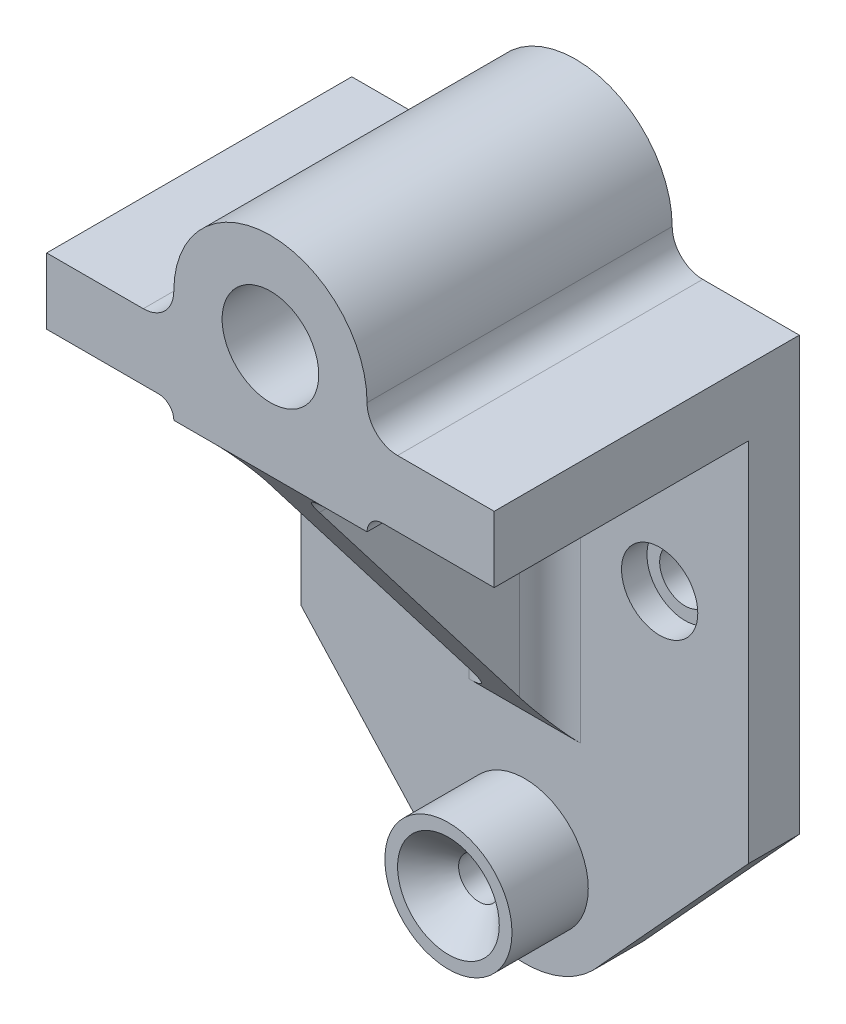
ISO-10303-21;
HEADER;
FILE_DESCRIPTION(('STEP AP214'),'2;1');
FILE_NAME('part.step','',(''),(''),'','','');
FILE_SCHEMA(('AUTOMOTIVE_DESIGN { 1 0 10303 214 1 1 1 1 }'));
ENDSEC;
DATA;
#1=APPLICATION_CONTEXT('core data for automotive mechanical design processes');
#2=APPLICATION_PROTOCOL_DEFINITION('international standard','automotive_design',2000,#1);
#3=PRODUCT_CONTEXT('',#1,'mechanical');
#4=PRODUCT('Part','Part','',(#3));
#5=PRODUCT_RELATED_PRODUCT_CATEGORY('part','',(#4));
#6=PRODUCT_DEFINITION_FORMATION('','',#4);
#7=PRODUCT_DEFINITION_CONTEXT('part definition',#1,'design');
#8=PRODUCT_DEFINITION('design','',#6,#7);
#9=PRODUCT_DEFINITION_SHAPE('','',#8);
#10=(LENGTH_UNIT() NAMED_UNIT(*) SI_UNIT(.MILLI.,.METRE.));
#11=(NAMED_UNIT(*) PLANE_ANGLE_UNIT() SI_UNIT($,.RADIAN.));
#12=(NAMED_UNIT(*) SI_UNIT($,.STERADIAN.) SOLID_ANGLE_UNIT());
#13=UNCERTAINTY_MEASURE_WITH_UNIT(LENGTH_MEASURE(1.E-05),#10,'distance_accuracy_value','');
#14=(GEOMETRIC_REPRESENTATION_CONTEXT(3) GLOBAL_UNCERTAINTY_ASSIGNED_CONTEXT((#13)) GLOBAL_UNIT_ASSIGNED_CONTEXT((#10,
#11,#12)) REPRESENTATION_CONTEXT('',''));
#15=CARTESIAN_POINT('',(0.,0.,0.));
#16=DIRECTION('',(0.,0.,1.));
#17=DIRECTION('',(1.,0.,0.));
#18=AXIS2_PLACEMENT_3D('',#15,#16,#17);
#19=CARTESIAN_POINT('',(0.,0.,60.));
#20=DIRECTION('',(0.,1.,0.));
#21=DIRECTION('',(0.,0.,1.));
#22=AXIS2_PLACEMENT_3D('',#19,#20,#21);
#23=PLANE('',#22);
#24=DIRECTION('',(1.,0.,0.));
#25=VECTOR('',#24,1.);
#26=CARTESIAN_POINT('',(0.,0.,60.));
#27=LINE('',#26,#25);
#28=CARTESIAN_POINT('',(30.,0.,60.));
#29=VERTEX_POINT('',#28);
#30=CARTESIAN_POINT('',(38.,0.,60.));
#31=VERTEX_POINT('',#30);
#32=EDGE_CURVE('E232',#29,#31,#27,.T.);
#33=ORIENTED_EDGE('',*,*,#32,.F.);
#34=DIRECTION('',(0.,0.,1.));
#35=VECTOR('',#34,1.);
#36=CARTESIAN_POINT('',(30.,0.,10.));
#37=LINE('',#36,#35);
#38=CARTESIAN_POINT('',(30.,0.,10.));
#39=VERTEX_POINT('',#38);
#40=EDGE_CURVE('E314',#29,#39,#37,.F.);
#41=ORIENTED_EDGE('',*,*,#40,.T.);
#42=DIRECTION('',(1.,0.,0.));
#43=VECTOR('',#42,1.);
#44=CARTESIAN_POINT('',(0.,0.,10.));
#45=LINE('',#44,#43);
#46=CARTESIAN_POINT('',(38.,0.,10.));
#47=VERTEX_POINT('',#46);
#48=EDGE_CURVE('E358',#39,#47,#45,.T.);
#49=ORIENTED_EDGE('',*,*,#48,.T.);
#50=DIRECTION('',(0.,0.,-1.));
#51=VECTOR('',#50,1.);
#52=CARTESIAN_POINT('',(38.,0.,60.));
#53=LINE('',#52,#51);
#54=EDGE_CURVE('E274',#31,#47,#53,.T.);
#55=ORIENTED_EDGE('',*,*,#54,.F.);
#56=EDGE_LOOP('',(#33,#41,#49,#55));
#57=FACE_BOUND('',#56,.T.);
#58=ADVANCED_FACE('F37',(#57),#23,.F.);
#59=CARTESIAN_POINT('',(0.,0.,10.));
#60=DIRECTION('',(0.,0.,1.));
#61=DIRECTION('',(1.,0.,0.));
#62=AXIS2_PLACEMENT_3D('',#59,#60,#61);
#63=PLANE('',#62);
#64=CARTESIAN_POINT('',(45.5363519866529,-31.3518574194529,10.));
#65=DIRECTION('',(0.,0.,1.));
#66=DIRECTION('',(1.,0.,0.));
#67=AXIS2_PLACEMENT_3D('',#64,#65,#66);
#68=CIRCLE('',#67,7.50000000000001);
#69=CARTESIAN_POINT('',(53.0363519866529,-31.3518574194529,10.));
#70=VERTEX_POINT('',#69);
#71=EDGE_CURVE('E768',#70,#70,#68,.T.);
#72=ORIENTED_EDGE('',*,*,#71,.F.);
#73=EDGE_LOOP('',(#72));
#74=FACE_BOUND('',#73,.T.);
#75=CARTESIAN_POINT('',(-7.53635198665288,-31.3518574194529,10.));
#76=DIRECTION('',(0.,0.,1.));
#77=DIRECTION('',(1.,0.,0.));
#78=AXIS2_PLACEMENT_3D('',#75,#76,#77);
#79=CIRCLE('',#78,7.50000000000001);
#80=CARTESIAN_POINT('',(-0.0363519866528666,-31.3518574194529,10.));
#81=VERTEX_POINT('',#80);
#82=EDGE_CURVE('E778',#81,#81,#79,.T.);
#83=ORIENTED_EDGE('',*,*,#82,.F.);
#84=EDGE_LOOP('',(#83));
#85=FACE_BOUND('',#84,.T.);
#86=CARTESIAN_POINT('',(19.,-89.,10.));
#87=DIRECTION('',(0.,0.,1.));
#88=DIRECTION('',(1.,0.,0.));
#89=AXIS2_PLACEMENT_3D('',#86,#87,#88);
#90=CIRCLE('',#89,12.5);
#91=CARTESIAN_POINT('',(31.5,-89.,10.));
#92=VERTEX_POINT('',#91);
#93=EDGE_CURVE('E361',#92,#92,#90,.T.);
#94=ORIENTED_EDGE('',*,*,#93,.F.);
#95=EDGE_LOOP('',(#94));
#96=FACE_BOUND('',#95,.T.);
#97=ORIENTED_EDGE('',*,*,#48,.F.);
#98=DIRECTION('',(0.,1.,0.));
#99=VECTOR('',#98,1.);
#100=CARTESIAN_POINT('',(30.,0.,10.));
#101=LINE('',#100,#99);
#102=CARTESIAN_POINT('',(30.,-65.,9.99999999999999));
#103=VERTEX_POINT('',#102);
#104=EDGE_CURVE('E330',#39,#103,#101,.F.);
#105=ORIENTED_EDGE('',*,*,#104,.T.);
#106=DIRECTION('',(-1.,0.,0.));
#107=VECTOR('',#106,1.);
#108=CARTESIAN_POINT('',(24.,-65.,9.99999999999999));
#109=LINE('',#108,#107);
#110=CARTESIAN_POINT('',(8.,-65.,9.99999999999999));
#111=VERTEX_POINT('',#110);
#112=EDGE_CURVE('E341',#103,#111,#109,.T.);
#113=ORIENTED_EDGE('',*,*,#112,.T.);
#114=DIRECTION('',(0.,1.,0.));
#115=VECTOR('',#114,1.);
#116=CARTESIAN_POINT('',(8.,-6.,10.));
#117=LINE('',#116,#115);
#118=CARTESIAN_POINT('',(8.,0.,10.));
#119=VERTEX_POINT('',#118);
#120=EDGE_CURVE('E327',#111,#119,#117,.T.);
#121=ORIENTED_EDGE('',*,*,#120,.T.);
#122=CARTESIAN_POINT('',(0.,0.,10.));
#123=VERTEX_POINT('',#122);
#124=EDGE_CURVE('E360',#123,#119,#45,.T.);
#125=ORIENTED_EDGE('',*,*,#124,.F.);
#126=CARTESIAN_POINT('',(-3.,0.,10.));
#127=DIRECTION('',(0.,0.,1.));
#128=DIRECTION('',(1.,0.,0.));
#129=AXIS2_PLACEMENT_3D('',#126,#127,#128);
#130=CIRCLE('',#129,3.);
#131=CARTESIAN_POINT('',(-3.,3.,10.));
#132=VERTEX_POINT('',#131);
#133=EDGE_CURVE('E296',#123,#132,#130,.T.);
#134=ORIENTED_EDGE('',*,*,#133,.T.);
#135=DIRECTION('',(1.,0.,0.));
#136=VECTOR('',#135,1.);
#137=CARTESIAN_POINT('',(0.,3.,10.));
#138=LINE('',#137,#136);
#139=CARTESIAN_POINT('',(-25.,3.,10.));
#140=VERTEX_POINT('',#139);
#141=EDGE_CURVE('E207',#140,#132,#138,.T.);
#142=ORIENTED_EDGE('',*,*,#141,.F.);
#143=DIRECTION('',(0.,-1.,0.));
#144=VECTOR('',#143,1.);
#145=CARTESIAN_POINT('',(-25.,0.,10.));
#146=LINE('',#145,#144);
#147=CARTESIAN_POINT('',(-25.,-69.,10.));
#148=VERTEX_POINT('',#147);
#149=EDGE_CURVE('E200',#140,#148,#146,.T.);
#150=ORIENTED_EDGE('',*,*,#149,.T.);
#151=DIRECTION('',(0.674608213282389,-0.738175967213741,0.));
#152=VECTOR('',#151,1.);
#153=CARTESIAN_POINT('',(-47.9831843170728,-43.8511299167875,10.));
#154=LINE('',#153,#152);
#155=CARTESIAN_POINT('',(4.52041849490884,-101.302102236505,10.));
#156=VERTEX_POINT('',#155);
#157=EDGE_CURVE('E190',#148,#156,#154,.T.);
#158=ORIENTED_EDGE('',*,*,#157,.T.);
#159=CARTESIAN_POINT('',(19.,-89.,10.));
#160=DIRECTION('',(0.,0.,1.));
#161=DIRECTION('',(1.,0.,0.));
#162=AXIS2_PLACEMENT_3D('',#159,#160,#161);
#163=CIRCLE('',#162,19.);
#164=CARTESIAN_POINT('',(32.3856262440448,-102.484250444676,10.));
#165=VERTEX_POINT('',#164);
#166=EDGE_CURVE('E199',#156,#165,#163,.T.);
#167=ORIENTED_EDGE('',*,*,#166,.T.);
#168=DIRECTION('',(-0.674771623689524,-0.738026595634198,0.));
#169=VECTOR('',#168,1.);
#170=CARTESIAN_POINT('',(68.677004013482,-62.7908178139399,10.));
#171=LINE('',#170,#169);
#172=CARTESIAN_POINT('',(63.,-69.,10.));
#173=VERTEX_POINT('',#172);
#174=EDGE_CURVE('E371',#173,#165,#171,.T.);
#175=ORIENTED_EDGE('',*,*,#174,.F.);
#176=DIRECTION('',(0.,-1.,0.));
#177=VECTOR('',#176,1.);
#178=CARTESIAN_POINT('',(63.,0.,10.));
#179=LINE('',#178,#177);
#180=CARTESIAN_POINT('',(63.,3.,9.99999999999999));
#181=VERTEX_POINT('',#180);
#182=EDGE_CURVE('E374',#181,#173,#179,.T.);
#183=ORIENTED_EDGE('',*,*,#182,.F.);
#184=DIRECTION('',(1.,0.,0.));
#185=VECTOR('',#184,1.);
#186=CARTESIAN_POINT('',(0.,3.,10.));
#187=LINE('',#186,#185);
#188=CARTESIAN_POINT('',(41.,3.,10.));
#189=VERTEX_POINT('',#188);
#190=EDGE_CURVE('E377',#189,#181,#187,.T.);
#191=ORIENTED_EDGE('',*,*,#190,.F.);
#192=CARTESIAN_POINT('',(41.,0.,10.));
#193=DIRECTION('',(0.,0.,1.));
#194=DIRECTION('',(1.,0.,0.));
#195=AXIS2_PLACEMENT_3D('',#192,#193,#194);
#196=CIRCLE('',#195,3.);
#197=EDGE_CURVE('E293',#189,#47,#196,.T.);
#198=ORIENTED_EDGE('',*,*,#197,.T.);
#199=EDGE_LOOP('',(#97,#105,#113,#121,#125,#134,#142,#150,#158,#167,#175,#183,#191,#198));
#200=FACE_BOUND('',#199,.T.);
#201=ADVANCED_FACE('F205',(#74,#85,#96,#200),#63,.T.);
#202=CARTESIAN_POINT('',(19.,22.,60.));
#203=DIRECTION('',(0.,0.,1.));
#204=DIRECTION('',(1.,0.,0.));
#205=AXIS2_PLACEMENT_3D('',#202,#203,#204);
#206=PLANE('',#205);
#207=DIRECTION('',(1.,0.,0.));
#208=VECTOR('',#207,1.);
#209=CARTESIAN_POINT('',(-25.,3.,60.));
#210=LINE('',#209,#208);
#211=CARTESIAN_POINT('',(-25.,3.,60.));
#212=VERTEX_POINT('',#211);
#213=CARTESIAN_POINT('',(-3.,3.,60.));
#214=VERTEX_POINT('',#213);
#215=EDGE_CURVE('E245',#212,#214,#210,.T.);
#216=ORIENTED_EDGE('',*,*,#215,.T.);
#217=CARTESIAN_POINT('',(-3.,0.,60.));
#218=DIRECTION('',(0.,0.,1.));
#219=DIRECTION('',(1.,0.,0.));
#220=AXIS2_PLACEMENT_3D('',#217,#218,#219);
#221=CIRCLE('',#220,3.);
#222=CARTESIAN_POINT('',(0.,0.,60.));
#223=VERTEX_POINT('',#222);
#224=EDGE_CURVE('E303',#214,#223,#221,.F.);
#225=ORIENTED_EDGE('',*,*,#224,.T.);
#226=CARTESIAN_POINT('',(8.,0.,60.));
#227=VERTEX_POINT('',#226);
#228=EDGE_CURVE('E228',#223,#227,#27,.T.);
#229=ORIENTED_EDGE('',*,*,#228,.T.);
#230=DIRECTION('',(-1.,0.,0.));
#231=VECTOR('',#230,1.);
#232=CARTESIAN_POINT('',(24.,0.,60.));
#233=LINE('',#232,#231);
#234=EDGE_CURVE('E383',#29,#227,#233,.T.);
#235=ORIENTED_EDGE('',*,*,#234,.F.);
#236=ORIENTED_EDGE('',*,*,#32,.T.);
#237=CARTESIAN_POINT('',(41.,0.,60.));
#238=DIRECTION('',(0.,0.,1.));
#239=DIRECTION('',(1.,0.,0.));
#240=AXIS2_PLACEMENT_3D('',#237,#238,#239);
#241=CIRCLE('',#240,3.);
#242=CARTESIAN_POINT('',(41.,3.,60.));
#243=VERTEX_POINT('',#242);
#244=EDGE_CURVE('E305',#31,#243,#241,.F.);
#245=ORIENTED_EDGE('',*,*,#244,.T.);
#246=DIRECTION('',(1.,0.,0.));
#247=VECTOR('',#246,1.);
#248=CARTESIAN_POINT('',(38.,3.,60.));
#249=LINE('',#248,#247);
#250=CARTESIAN_POINT('',(63.,3.,60.));
#251=VERTEX_POINT('',#250);
#252=EDGE_CURVE('E231',#243,#251,#249,.T.);
#253=ORIENTED_EDGE('',*,*,#252,.T.);
#254=DIRECTION('',(0.,1.,0.));
#255=VECTOR('',#254,1.);
#256=CARTESIAN_POINT('',(63.,3.,60.));
#257=LINE('',#256,#255);
#258=CARTESIAN_POINT('',(63.,16.,60.));
#259=VERTEX_POINT('',#258);
#260=EDGE_CURVE('E234',#251,#259,#257,.T.);
#261=ORIENTED_EDGE('',*,*,#260,.T.);
#262=DIRECTION('',(-1.,0.,0.));
#263=VECTOR('',#262,1.);
#264=CARTESIAN_POINT('',(63.,16.,60.));
#265=LINE('',#264,#263);
#266=CARTESIAN_POINT('',(44.,16.,60.));
#267=VERTEX_POINT('',#266);
#268=EDGE_CURVE('E236',#259,#267,#265,.T.);
#269=ORIENTED_EDGE('',*,*,#268,.T.);
#270=CARTESIAN_POINT('',(44.,22.,60.));
#271=DIRECTION('',(0.,0.,1.));
#272=DIRECTION('',(1.,0.,0.));
#273=AXIS2_PLACEMENT_3D('',#270,#271,#272);
#274=CIRCLE('',#273,6.);
#275=CARTESIAN_POINT('',(38.,22.,60.));
#276=VERTEX_POINT('',#275);
#277=EDGE_CURVE('E291',#267,#276,#274,.F.);
#278=ORIENTED_EDGE('',*,*,#277,.T.);
#279=CARTESIAN_POINT('',(19.,22.,60.));
#280=DIRECTION('',(0.,0.,1.));
#281=DIRECTION('',(1.,0.,0.));
#282=AXIS2_PLACEMENT_3D('',#279,#280,#281);
#283=CIRCLE('',#282,19.);
#284=CARTESIAN_POINT('',(0.,22.,60.));
#285=VERTEX_POINT('',#284);
#286=EDGE_CURVE('E239',#276,#285,#283,.T.);
#287=ORIENTED_EDGE('',*,*,#286,.T.);
#288=CARTESIAN_POINT('',(-6.,22.,60.));
#289=DIRECTION('',(0.,0.,1.));
#290=DIRECTION('',(1.,0.,0.));
#291=AXIS2_PLACEMENT_3D('',#288,#289,#290);
#292=CIRCLE('',#291,6.);
#293=CARTESIAN_POINT('',(-6.,16.,60.));
#294=VERTEX_POINT('',#293);
#295=EDGE_CURVE('E285',#285,#294,#292,.F.);
#296=ORIENTED_EDGE('',*,*,#295,.T.);
#297=DIRECTION('',(-1.,0.,0.));
#298=VECTOR('',#297,1.);
#299=CARTESIAN_POINT('',(0.,16.,60.));
#300=LINE('',#299,#298);
#301=CARTESIAN_POINT('',(-25.,16.,60.));
#302=VERTEX_POINT('',#301);
#303=EDGE_CURVE('E241',#294,#302,#300,.T.);
#304=ORIENTED_EDGE('',*,*,#303,.T.);
#305=DIRECTION('',(0.,-1.,0.));
#306=VECTOR('',#305,1.);
#307=CARTESIAN_POINT('',(-25.,16.,60.));
#308=LINE('',#307,#306);
#309=EDGE_CURVE('E243',#302,#212,#308,.T.);
#310=ORIENTED_EDGE('',*,*,#309,.T.);
#311=EDGE_LOOP('',(#216,#225,#229,#235,#236,#245,#253,#261,#269,#278,#287,#296,#304,#310));
#312=FACE_BOUND('',#311,.T.);
#313=CARTESIAN_POINT('',(19.,22.,60.));
#314=DIRECTION('',(0.,0.,1.));
#315=DIRECTION('',(1.,0.,0.));
#316=AXIS2_PLACEMENT_3D('',#313,#314,#315);
#317=CIRCLE('',#316,9.5);
#318=CARTESIAN_POINT('',(28.5,22.,60.));
#319=VERTEX_POINT('',#318);
#320=EDGE_CURVE('E219',#319,#319,#317,.T.);
#321=ORIENTED_EDGE('',*,*,#320,.F.);
#322=EDGE_LOOP('',(#321));
#323=FACE_BOUND('',#322,.T.);
#324=ADVANCED_FACE('F412',(#312,#323),#206,.T.);
#325=CARTESIAN_POINT('',(19.,22.,0.));
#326=DIRECTION('',(0.,0.,1.));
#327=DIRECTION('',(1.,0.,0.));
#328=AXIS2_PLACEMENT_3D('',#325,#326,#327);
#329=PLANE('',#328);
#330=CARTESIAN_POINT('',(45.5363519866529,-31.3518574194529,0.));
#331=DIRECTION('',(0.,0.,1.));
#332=DIRECTION('',(1.,0.,0.));
#333=AXIS2_PLACEMENT_3D('',#330,#331,#332);
#334=CIRCLE('',#333,5.00000000000001);
#335=CARTESIAN_POINT('',(50.5363519866529,-31.3518574194529,0.));
#336=VERTEX_POINT('',#335);
#337=EDGE_CURVE('E775',#336,#336,#334,.T.);
#338=ORIENTED_EDGE('',*,*,#337,.T.);
#339=EDGE_LOOP('',(#338));
#340=FACE_BOUND('',#339,.T.);
#341=CARTESIAN_POINT('',(-7.53635198665288,-31.3518574194529,0.));
#342=DIRECTION('',(0.,0.,1.));
#343=DIRECTION('',(1.,0.,0.));
#344=AXIS2_PLACEMENT_3D('',#341,#342,#343);
#345=CIRCLE('',#344,5.00000000000001);
#346=CARTESIAN_POINT('',(-2.53635198665287,-31.3518574194529,0.));
#347=VERTEX_POINT('',#346);
#348=EDGE_CURVE('E787',#347,#347,#345,.T.);
#349=ORIENTED_EDGE('',*,*,#348,.T.);
#350=EDGE_LOOP('',(#349));
#351=FACE_BOUND('',#350,.T.);
#352=DIRECTION('',(0.,1.,0.));
#353=VECTOR('',#352,1.);
#354=CARTESIAN_POINT('',(63.,3.,0.));
#355=LINE('',#354,#353);
#356=CARTESIAN_POINT('',(63.,-69.,0.));
#357=VERTEX_POINT('',#356);
#358=CARTESIAN_POINT('',(63.,16.,0.));
#359=VERTEX_POINT('',#358);
#360=EDGE_CURVE('E226',#357,#359,#355,.T.);
#361=ORIENTED_EDGE('',*,*,#360,.F.);
#362=DIRECTION('',(-0.674771623689524,-0.738026595634198,0.));
#363=VECTOR('',#362,1.);
#364=CARTESIAN_POINT('',(68.677004013482,-62.7908178139399,0.));
#365=LINE('',#364,#363);
#366=CARTESIAN_POINT('',(32.3856262440448,-102.484250444676,0.));
#367=VERTEX_POINT('',#366);
#368=EDGE_CURVE('E365',#357,#367,#365,.T.);
#369=ORIENTED_EDGE('',*,*,#368,.T.);
#370=CARTESIAN_POINT('',(19.,-89.,0.));
#371=DIRECTION('',(0.,0.,1.));
#372=DIRECTION('',(1.,0.,0.));
#373=AXIS2_PLACEMENT_3D('',#370,#371,#372);
#374=CIRCLE('',#373,19.);
#375=CARTESIAN_POINT('',(4.52041849490884,-101.302102236505,0.));
#376=VERTEX_POINT('',#375);
#377=EDGE_CURVE('E382',#376,#367,#374,.T.);
#378=ORIENTED_EDGE('',*,*,#377,.F.);
#379=DIRECTION('',(0.674608213282389,-0.738175967213741,0.));
#380=VECTOR('',#379,1.);
#381=CARTESIAN_POINT('',(-47.9831843170728,-43.8511299167875,0.));
#382=LINE('',#381,#380);
#383=CARTESIAN_POINT('',(-25.,-69.,0.));
#384=VERTEX_POINT('',#383);
#385=EDGE_CURVE('E380',#384,#376,#382,.T.);
#386=ORIENTED_EDGE('',*,*,#385,.F.);
#387=DIRECTION('',(0.,-1.,0.));
#388=VECTOR('',#387,1.);
#389=CARTESIAN_POINT('',(-25.,16.,0.));
#390=LINE('',#389,#388);
#391=CARTESIAN_POINT('',(-25.,16.,0.));
#392=VERTEX_POINT('',#391);
#393=EDGE_CURVE('E214',#392,#384,#390,.T.);
#394=ORIENTED_EDGE('',*,*,#393,.F.);
#395=DIRECTION('',(-1.,0.,0.));
#396=VECTOR('',#395,1.);
#397=CARTESIAN_POINT('',(0.,16.,0.));
#398=LINE('',#397,#396);
#399=CARTESIAN_POINT('',(-6.,16.,0.));
#400=VERTEX_POINT('',#399);
#401=EDGE_CURVE('E256',#400,#392,#398,.T.);
#402=ORIENTED_EDGE('',*,*,#401,.F.);
#403=CARTESIAN_POINT('',(-6.,22.,0.));
#404=DIRECTION('',(0.,0.,1.));
#405=DIRECTION('',(1.,0.,0.));
#406=AXIS2_PLACEMENT_3D('',#403,#404,#405);
#407=CIRCLE('',#406,6.);
#408=CARTESIAN_POINT('',(0.,22.,0.));
#409=VERTEX_POINT('',#408);
#410=EDGE_CURVE('E283',#400,#409,#407,.T.);
#411=ORIENTED_EDGE('',*,*,#410,.T.);
#412=CARTESIAN_POINT('',(19.,22.,0.));
#413=DIRECTION('',(0.,0.,1.));
#414=DIRECTION('',(1.,0.,0.));
#415=AXIS2_PLACEMENT_3D('',#412,#413,#414);
#416=CIRCLE('',#415,19.);
#417=CARTESIAN_POINT('',(38.,22.,0.));
#418=VERTEX_POINT('',#417);
#419=EDGE_CURVE('E253',#418,#409,#416,.T.);
#420=ORIENTED_EDGE('',*,*,#419,.F.);
#421=CARTESIAN_POINT('',(44.,22.,0.));
#422=DIRECTION('',(0.,0.,1.));
#423=DIRECTION('',(1.,0.,0.));
#424=AXIS2_PLACEMENT_3D('',#421,#422,#423);
#425=CIRCLE('',#424,6.);
#426=CARTESIAN_POINT('',(44.,16.,0.));
#427=VERTEX_POINT('',#426);
#428=EDGE_CURVE('E289',#418,#427,#425,.T.);
#429=ORIENTED_EDGE('',*,*,#428,.T.);
#430=DIRECTION('',(-1.,0.,0.));
#431=VECTOR('',#430,1.);
#432=CARTESIAN_POINT('',(63.,16.,0.));
#433=LINE('',#432,#431);
#434=EDGE_CURVE('E250',#359,#427,#433,.T.);
#435=ORIENTED_EDGE('',*,*,#434,.F.);
#436=EDGE_LOOP('',(#361,#369,#378,#386,#394,#402,#411,#420,#429,#435));
#437=FACE_BOUND('',#436,.T.);
#438=CARTESIAN_POINT('',(19.,22.,0.));
#439=DIRECTION('',(0.,0.,1.));
#440=DIRECTION('',(1.,0.,0.));
#441=AXIS2_PLACEMENT_3D('',#438,#439,#440);
#442=CIRCLE('',#441,9.5);
#443=CARTESIAN_POINT('',(28.5,22.,0.));
#444=VERTEX_POINT('',#443);
#445=EDGE_CURVE('E216',#444,#444,#442,.T.);
#446=ORIENTED_EDGE('',*,*,#445,.T.);
#447=EDGE_LOOP('',(#446));
#448=FACE_BOUND('',#447,.T.);
#449=CARTESIAN_POINT('',(19.,-89.,0.));
#450=DIRECTION('',(0.,0.,1.));
#451=DIRECTION('',(1.,0.,0.));
#452=AXIS2_PLACEMENT_3D('',#449,#450,#451);
#453=CIRCLE('',#452,12.5);
#454=CARTESIAN_POINT('',(31.5,-89.,0.));
#455=VERTEX_POINT('',#454);
#456=EDGE_CURVE('E455',#455,#455,#453,.F.);
#457=ORIENTED_EDGE('',*,*,#456,.F.);
#458=EDGE_LOOP('',(#457));
#459=FACE_BOUND('',#458,.T.);
#460=ADVANCED_FACE('F397',(#340,#351,#437,#448,#459),#329,.F.);
#461=ORIENTED_EDGE('',*,*,#124,.T.);
#462=DIRECTION('',(0.,0.,1.));
#463=VECTOR('',#462,1.);
#464=CARTESIAN_POINT('',(8.,0.,60.));
#465=LINE('',#464,#463);
#466=EDGE_CURVE('E307',#119,#227,#465,.T.);
#467=ORIENTED_EDGE('',*,*,#466,.T.);
#468=ORIENTED_EDGE('',*,*,#228,.F.);
#469=DIRECTION('',(0.,0.,-1.));
#470=VECTOR('',#469,1.);
#471=CARTESIAN_POINT('',(0.,0.,60.));
#472=LINE('',#471,#470);
#473=EDGE_CURVE('E277',#223,#123,#472,.T.);
#474=ORIENTED_EDGE('',*,*,#473,.T.);
#475=EDGE_LOOP('',(#461,#467,#468,#474));
#476=FACE_BOUND('',#475,.T.);
#477=ADVANCED_FACE('F432',(#476),#23,.F.);
#478=CARTESIAN_POINT('',(38.,3.,60.));
#479=DIRECTION('',(0.,1.,0.));
#480=DIRECTION('',(0.,0.,1.));
#481=AXIS2_PLACEMENT_3D('',#478,#479,#480);
#482=PLANE('',#481);
#483=ORIENTED_EDGE('',*,*,#252,.F.);
#484=DIRECTION('',(0.,0.,-1.));
#485=VECTOR('',#484,1.);
#486=CARTESIAN_POINT('',(41.,3.,10.));
#487=LINE('',#486,#485);
#488=EDGE_CURVE('E300',#243,#189,#487,.T.);
#489=ORIENTED_EDGE('',*,*,#488,.T.);
#490=ORIENTED_EDGE('',*,*,#190,.T.);
#491=DIRECTION('',(0.,0.,-1.));
#492=VECTOR('',#491,1.);
#493=CARTESIAN_POINT('',(63.,3.,60.));
#494=LINE('',#493,#492);
#495=EDGE_CURVE('E271',#251,#181,#494,.T.);
#496=ORIENTED_EDGE('',*,*,#495,.F.);
#497=EDGE_LOOP('',(#483,#489,#490,#496));
#498=FACE_BOUND('',#497,.T.);
#499=ADVANCED_FACE('F407',(#498),#482,.F.);
#500=CARTESIAN_POINT('',(63.,3.,60.));
#501=DIRECTION('',(-1.,0.,0.));
#502=DIRECTION('',(0.,0.,1.));
#503=AXIS2_PLACEMENT_3D('',#500,#501,#502);
#504=PLANE('',#503);
#505=ORIENTED_EDGE('',*,*,#360,.T.);
#506=DIRECTION('',(0.,0.,-1.));
#507=VECTOR('',#506,1.);
#508=CARTESIAN_POINT('',(63.,16.,60.));
#509=LINE('',#508,#507);
#510=EDGE_CURVE('E268',#259,#359,#509,.T.);
#511=ORIENTED_EDGE('',*,*,#510,.F.);
#512=ORIENTED_EDGE('',*,*,#260,.F.);
#513=ORIENTED_EDGE('',*,*,#495,.T.);
#514=ORIENTED_EDGE('',*,*,#182,.T.);
#515=DIRECTION('',(0.,0.,-1.));
#516=VECTOR('',#515,1.);
#517=CARTESIAN_POINT('',(63.,-69.,10.));
#518=LINE('',#517,#516);
#519=EDGE_CURVE('E379',#173,#357,#518,.T.);
#520=ORIENTED_EDGE('',*,*,#519,.T.);
#521=EDGE_LOOP('',(#505,#511,#512,#513,#514,#520));
#522=FACE_BOUND('',#521,.T.);
#523=ADVANCED_FACE('F402',(#522),#504,.F.);
#524=CARTESIAN_POINT('',(63.,16.,60.));
#525=DIRECTION('',(0.,-1.,0.));
#526=DIRECTION('',(1.,0.,0.));
#527=AXIS2_PLACEMENT_3D('',#524,#525,#526);
#528=PLANE('',#527);
#529=ORIENTED_EDGE('',*,*,#434,.T.);
#530=DIRECTION('',(0.,0.,-1.));
#531=VECTOR('',#530,1.);
#532=CARTESIAN_POINT('',(44.,16.,60.));
#533=LINE('',#532,#531);
#534=EDGE_CURVE('E287',#427,#267,#533,.F.);
#535=ORIENTED_EDGE('',*,*,#534,.T.);
#536=ORIENTED_EDGE('',*,*,#268,.F.);
#537=ORIENTED_EDGE('',*,*,#510,.T.);
#538=EDGE_LOOP('',(#529,#535,#536,#537));
#539=FACE_BOUND('',#538,.T.);
#540=ADVANCED_FACE('F513',(#539),#528,.F.);
#541=CARTESIAN_POINT('',(19.,22.,60.));
#542=DIRECTION('',(0.,0.,-1.));
#543=DIRECTION('',(-1.,0.,0.));
#544=AXIS2_PLACEMENT_3D('',#541,#542,#543);
#545=CYLINDRICAL_SURFACE('',#544,19.);
#546=ORIENTED_EDGE('',*,*,#419,.T.);
#547=DIRECTION('',(0.,0.,-1.));
#548=VECTOR('',#547,1.);
#549=CARTESIAN_POINT('',(0.,22.,60.));
#550=LINE('',#549,#548);
#551=EDGE_CURVE('E262',#285,#409,#550,.T.);
#552=ORIENTED_EDGE('',*,*,#551,.F.);
#553=ORIENTED_EDGE('',*,*,#286,.F.);
#554=DIRECTION('',(0.,0.,-1.));
#555=VECTOR('',#554,1.);
#556=CARTESIAN_POINT('',(38.,22.,60.));
#557=LINE('',#556,#555);
#558=EDGE_CURVE('E265',#276,#418,#557,.T.);
#559=ORIENTED_EDGE('',*,*,#558,.T.);
#560=EDGE_LOOP('',(#546,#552,#553,#559));
#561=FACE_BOUND('',#560,.T.);
#562=ADVANCED_FACE('F509',(#561),#545,.T.);
#563=CARTESIAN_POINT('',(0.,16.,60.));
#564=DIRECTION('',(0.,-1.,0.));
#565=DIRECTION('',(1.,0.,0.));
#566=AXIS2_PLACEMENT_3D('',#563,#564,#565);
#567=PLANE('',#566);
#568=ORIENTED_EDGE('',*,*,#303,.F.);
#569=DIRECTION('',(0.,0.,-1.));
#570=VECTOR('',#569,1.);
#571=CARTESIAN_POINT('',(-6.,16.,0.));
#572=LINE('',#571,#570);
#573=EDGE_CURVE('E280',#294,#400,#572,.T.);
#574=ORIENTED_EDGE('',*,*,#573,.T.);
#575=ORIENTED_EDGE('',*,*,#401,.T.);
#576=DIRECTION('',(0.,0.,-1.));
#577=VECTOR('',#576,1.);
#578=CARTESIAN_POINT('',(-25.,16.,60.));
#579=LINE('',#578,#577);
#580=EDGE_CURVE('E260',#302,#392,#579,.T.);
#581=ORIENTED_EDGE('',*,*,#580,.F.);
#582=EDGE_LOOP('',(#568,#574,#575,#581));
#583=FACE_BOUND('',#582,.T.);
#584=ADVANCED_FACE('F506',(#583),#567,.F.);
#585=CARTESIAN_POINT('',(-25.,16.,60.));
#586=DIRECTION('',(1.,0.,0.));
#587=DIRECTION('',(0.,0.,-1.));
#588=AXIS2_PLACEMENT_3D('',#585,#586,#587);
#589=PLANE('',#588);
#590=ORIENTED_EDGE('',*,*,#393,.T.);
#591=DIRECTION('',(0.,0.,-1.));
#592=VECTOR('',#591,1.);
#593=CARTESIAN_POINT('',(-25.,-69.,10.));
#594=LINE('',#593,#592);
#595=EDGE_CURVE('E195',#148,#384,#594,.T.);
#596=ORIENTED_EDGE('',*,*,#595,.F.);
#597=ORIENTED_EDGE('',*,*,#149,.F.);
#598=DIRECTION('',(0.,0.,-1.));
#599=VECTOR('',#598,1.);
#600=CARTESIAN_POINT('',(-25.,3.,60.));
#601=LINE('',#600,#599);
#602=EDGE_CURVE('E248',#212,#140,#601,.T.);
#603=ORIENTED_EDGE('',*,*,#602,.F.);
#604=ORIENTED_EDGE('',*,*,#309,.F.);
#605=ORIENTED_EDGE('',*,*,#580,.T.);
#606=EDGE_LOOP('',(#590,#596,#597,#603,#604,#605));
#607=FACE_BOUND('',#606,.T.);
#608=ADVANCED_FACE('F211',(#607),#589,.F.);
#609=CARTESIAN_POINT('',(-25.,3.,60.));
#610=DIRECTION('',(0.,1.,0.));
#611=DIRECTION('',(0.,0.,1.));
#612=AXIS2_PLACEMENT_3D('',#609,#610,#611);
#613=PLANE('',#612);
#614=ORIENTED_EDGE('',*,*,#141,.T.);
#615=DIRECTION('',(0.,0.,-1.));
#616=VECTOR('',#615,1.);
#617=CARTESIAN_POINT('',(-3.,3.,60.));
#618=LINE('',#617,#616);
#619=EDGE_CURVE('E298',#132,#214,#618,.F.);
#620=ORIENTED_EDGE('',*,*,#619,.T.);
#621=ORIENTED_EDGE('',*,*,#215,.F.);
#622=ORIENTED_EDGE('',*,*,#602,.T.);
#623=EDGE_LOOP('',(#614,#620,#621,#622));
#624=FACE_BOUND('',#623,.T.);
#625=ADVANCED_FACE('F497',(#624),#613,.F.);
#626=CARTESIAN_POINT('',(19.,22.,60.));
#627=DIRECTION('',(0.,0.,-1.));
#628=DIRECTION('',(-1.,0.,0.));
#629=AXIS2_PLACEMENT_3D('',#626,#627,#628);
#630=CYLINDRICAL_SURFACE('',#629,9.5);
#631=ORIENTED_EDGE('',*,*,#320,.T.);
#632=EDGE_LOOP('',(#631));
#633=FACE_BOUND('',#632,.T.);
#634=ORIENTED_EDGE('',*,*,#445,.F.);
#635=EDGE_LOOP('',(#634));
#636=FACE_BOUND('',#635,.T.);
#637=ADVANCED_FACE('F494',(#633,#636),#630,.F.);
#638=CARTESIAN_POINT('',(-47.9831843170728,-43.8511299167875,10.));
#639=DIRECTION('',(0.738175967213741,0.674608213282389,0.));
#640=DIRECTION('',(-0.674608213282389,0.738175967213741,0.));
#641=AXIS2_PLACEMENT_3D('',#638,#639,#640);
#642=PLANE('',#641);
#643=ORIENTED_EDGE('',*,*,#385,.T.);
#644=DIRECTION('',(0.,0.,-1.));
#645=VECTOR('',#644,1.);
#646=CARTESIAN_POINT('',(4.52041849490884,-101.302102236505,10.));
#647=LINE('',#646,#645);
#648=EDGE_CURVE('E197',#156,#376,#647,.T.);
#649=ORIENTED_EDGE('',*,*,#648,.F.);
#650=ORIENTED_EDGE('',*,*,#157,.F.);
#651=ORIENTED_EDGE('',*,*,#595,.T.);
#652=EDGE_LOOP('',(#643,#649,#650,#651));
#653=FACE_BOUND('',#652,.T.);
#654=ADVANCED_FACE('F193',(#653),#642,.F.);
#655=CARTESIAN_POINT('',(19.,-89.,10.));
#656=DIRECTION('',(0.,0.,-1.));
#657=DIRECTION('',(-1.,0.,0.));
#658=AXIS2_PLACEMENT_3D('',#655,#656,#657);
#659=CYLINDRICAL_SURFACE('',#658,19.);
#660=ORIENTED_EDGE('',*,*,#377,.T.);
#661=DIRECTION('',(0.,0.,-1.));
#662=VECTOR('',#661,1.);
#663=CARTESIAN_POINT('',(32.3856262440448,-102.484250444676,10.));
#664=LINE('',#663,#662);
#665=EDGE_CURVE('E221',#165,#367,#664,.T.);
#666=ORIENTED_EDGE('',*,*,#665,.F.);
#667=ORIENTED_EDGE('',*,*,#166,.F.);
#668=ORIENTED_EDGE('',*,*,#648,.T.);
#669=EDGE_LOOP('',(#660,#666,#667,#668));
#670=FACE_BOUND('',#669,.T.);
#671=ADVANCED_FACE('F395',(#670),#659,.T.);
#672=CARTESIAN_POINT('',(68.677004013482,-62.7908178139399,10.));
#673=DIRECTION('',(0.738026595634198,-0.674771623689524,0.));
#674=DIRECTION('',(0.674771623689524,0.738026595634198,0.));
#675=AXIS2_PLACEMENT_3D('',#672,#673,#674);
#676=PLANE('',#675);
#677=ORIENTED_EDGE('',*,*,#368,.F.);
#678=ORIENTED_EDGE('',*,*,#519,.F.);
#679=ORIENTED_EDGE('',*,*,#174,.T.);
#680=ORIENTED_EDGE('',*,*,#665,.T.);
#681=EDGE_LOOP('',(#677,#678,#679,#680));
#682=FACE_BOUND('',#681,.T.);
#683=ADVANCED_FACE('F392',(#682),#676,.T.);
#684=CARTESIAN_POINT('',(-6.,22.,60.));
#685=DIRECTION('',(0.,0.,1.));
#686=DIRECTION('',(1.,0.,0.));
#687=AXIS2_PLACEMENT_3D('',#684,#685,#686);
#688=CYLINDRICAL_SURFACE('',#687,6.);
#689=ORIENTED_EDGE('',*,*,#295,.F.);
#690=ORIENTED_EDGE('',*,*,#551,.T.);
#691=ORIENTED_EDGE('',*,*,#410,.F.);
#692=ORIENTED_EDGE('',*,*,#573,.F.);
#693=EDGE_LOOP('',(#689,#690,#691,#692));
#694=FACE_BOUND('',#693,.T.);
#695=ADVANCED_FACE('F489',(#694),#688,.F.);
#696=CARTESIAN_POINT('',(44.,22.,60.));
#697=DIRECTION('',(0.,0.,1.));
#698=DIRECTION('',(1.,0.,0.));
#699=AXIS2_PLACEMENT_3D('',#696,#697,#698);
#700=CYLINDRICAL_SURFACE('',#699,6.);
#701=ORIENTED_EDGE('',*,*,#277,.F.);
#702=ORIENTED_EDGE('',*,*,#534,.F.);
#703=ORIENTED_EDGE('',*,*,#428,.F.);
#704=ORIENTED_EDGE('',*,*,#558,.F.);
#705=EDGE_LOOP('',(#701,#702,#703,#704));
#706=FACE_BOUND('',#705,.T.);
#707=ADVANCED_FACE('F426',(#706),#700,.F.);
#708=CARTESIAN_POINT('',(-3.,0.,60.));
#709=DIRECTION('',(0.,0.,1.));
#710=DIRECTION('',(1.,0.,0.));
#711=AXIS2_PLACEMENT_3D('',#708,#709,#710);
#712=CYLINDRICAL_SURFACE('',#711,3.);
#713=ORIENTED_EDGE('',*,*,#224,.F.);
#714=ORIENTED_EDGE('',*,*,#619,.F.);
#715=ORIENTED_EDGE('',*,*,#133,.F.);
#716=ORIENTED_EDGE('',*,*,#473,.F.);
#717=EDGE_LOOP('',(#713,#714,#715,#716));
#718=FACE_BOUND('',#717,.T.);
#719=ADVANCED_FACE('F419',(#718),#712,.F.);
#720=CARTESIAN_POINT('',(41.,0.,60.));
#721=DIRECTION('',(0.,0.,1.));
#722=DIRECTION('',(1.,0.,0.));
#723=AXIS2_PLACEMENT_3D('',#720,#721,#722);
#724=CYLINDRICAL_SURFACE('',#723,3.);
#725=ORIENTED_EDGE('',*,*,#244,.F.);
#726=ORIENTED_EDGE('',*,*,#54,.T.);
#727=ORIENTED_EDGE('',*,*,#197,.F.);
#728=ORIENTED_EDGE('',*,*,#488,.F.);
#729=EDGE_LOOP('',(#725,#726,#727,#728));
#730=FACE_BOUND('',#729,.T.);
#731=ADVANCED_FACE('F417',(#730),#724,.F.);
#732=CARTESIAN_POINT('',(24.,0.,60.));
#733=DIRECTION('',(0.,0.609710760849692,-0.7926239891046));
#734=DIRECTION('',(0.,0.7926239891046,0.609710760849692));
#735=AXIS2_PLACEMENT_3D('',#732,#733,#734);
#736=PLANE('',#735);
#737=ORIENTED_EDGE('',*,*,#234,.T.);
#738=CARTESIAN_POINT('',(8.,-6.,55.3846153846154));
#739=DIRECTION('',(0.,0.609710760849692,-0.7926239891046));
#740=DIRECTION('',(0.,0.7926239891046,0.609710760849692));
#741=AXIS2_PLACEMENT_3D('',#738,#739,#740);
#742=ELLIPSE('',#741,7.56979360008772,6.);
#743=CARTESIAN_POINT('',(14.,-6.,55.3846153846154));
#744=VERTEX_POINT('',#743);
#745=EDGE_CURVE('E317',#227,#744,#742,.T.);
#746=ORIENTED_EDGE('',*,*,#745,.T.);
#747=DIRECTION('',(0.,-0.7926239891046,-0.609710760849692));
#748=VECTOR('',#747,1.);
#749=CARTESIAN_POINT('',(14.,0.,60.));
#750=LINE('',#749,#748);
#751=CARTESIAN_POINT('',(14.,-57.2,16.));
#752=VERTEX_POINT('',#751);
#753=EDGE_CURVE('E349',#744,#752,#750,.T.);
#754=ORIENTED_EDGE('',*,*,#753,.T.);
#755=CARTESIAN_POINT('',(8.,-57.2,16.));
#756=DIRECTION('',(0.,0.609710760849692,-0.7926239891046));
#757=DIRECTION('',(0.,-0.7926239891046,-0.609710760849692));
#758=AXIS2_PLACEMENT_3D('',#755,#756,#757);
#759=ELLIPSE('',#758,9.84073168011404,6.);
#760=EDGE_CURVE('E11',#752,#111,#759,.T.);
#761=ORIENTED_EDGE('',*,*,#760,.T.);
#762=ORIENTED_EDGE('',*,*,#112,.F.);
#763=CARTESIAN_POINT('',(30.,-57.2,16.));
#764=DIRECTION('',(0.,0.609710760849692,-0.7926239891046));
#765=DIRECTION('',(0.,0.7926239891046,0.609710760849692));
#766=AXIS2_PLACEMENT_3D('',#763,#764,#765);
#767=ELLIPSE('',#766,9.84073168011404,6.);
#768=CARTESIAN_POINT('',(24.,-57.2,16.));
#769=VERTEX_POINT('',#768);
#770=EDGE_CURVE('E46',#103,#769,#767,.T.);
#771=ORIENTED_EDGE('',*,*,#770,.T.);
#772=DIRECTION('',(0.,-0.7926239891046,-0.609710760849692));
#773=VECTOR('',#772,1.);
#774=CARTESIAN_POINT('',(24.,0.,60.));
#775=LINE('',#774,#773);
#776=CARTESIAN_POINT('',(24.,-6.,55.3846153846154));
#777=VERTEX_POINT('',#776);
#778=EDGE_CURVE('E340',#777,#769,#775,.T.);
#779=ORIENTED_EDGE('',*,*,#778,.F.);
#780=CARTESIAN_POINT('',(30.,-6.,55.3846153846154));
#781=DIRECTION('',(0.,0.609710760849692,-0.7926239891046));
#782=DIRECTION('',(0.,-0.7926239891046,-0.609710760849692));
#783=AXIS2_PLACEMENT_3D('',#780,#781,#782);
#784=ELLIPSE('',#783,7.56979360008772,6.);
#785=EDGE_CURVE('E319',#777,#29,#784,.T.);
#786=ORIENTED_EDGE('',*,*,#785,.T.);
#787=EDGE_LOOP('',(#737,#746,#754,#761,#762,#771,#779,#786));
#788=FACE_BOUND('',#787,.T.);
#789=ADVANCED_FACE('F339',(#788),#736,.F.);
#790=CARTESIAN_POINT('',(24.,0.,0.));
#791=DIRECTION('',(-1.,0.,0.));
#792=DIRECTION('',(0.,0.,1.));
#793=AXIS2_PLACEMENT_3D('',#790,#791,#792);
#794=PLANE('',#793);
#795=ORIENTED_EDGE('',*,*,#778,.T.);
#796=DIRECTION('',(0.,1.,0.));
#797=VECTOR('',#796,1.);
#798=CARTESIAN_POINT('',(24.,0.,16.));
#799=LINE('',#798,#797);
#800=CARTESIAN_POINT('',(24.,-6.,16.));
#801=VERTEX_POINT('',#800);
#802=EDGE_CURVE('E322',#769,#801,#799,.T.);
#803=ORIENTED_EDGE('',*,*,#802,.T.);
#804=DIRECTION('',(0.,0.,1.));
#805=VECTOR('',#804,1.);
#806=CARTESIAN_POINT('',(24.,-6.,60.));
#807=LINE('',#806,#805);
#808=EDGE_CURVE('E312',#801,#777,#807,.T.);
#809=ORIENTED_EDGE('',*,*,#808,.T.);
#810=EDGE_LOOP('',(#795,#803,#809));
#811=FACE_BOUND('',#810,.T.);
#812=ADVANCED_FACE('F346',(#811),#794,.F.);
#813=CARTESIAN_POINT('',(14.,0.,0.));
#814=DIRECTION('',(-1.,0.,0.));
#815=DIRECTION('',(0.,0.,1.));
#816=AXIS2_PLACEMENT_3D('',#813,#814,#815);
#817=PLANE('',#816);
#818=DIRECTION('',(0.,0.,1.));
#819=VECTOR('',#818,1.);
#820=CARTESIAN_POINT('',(14.,-6.,0.));
#821=LINE('',#820,#819);
#822=CARTESIAN_POINT('',(14.,-6.,16.));
#823=VERTEX_POINT('',#822);
#824=EDGE_CURVE('E310',#744,#823,#821,.F.);
#825=ORIENTED_EDGE('',*,*,#824,.T.);
#826=DIRECTION('',(0.,1.,0.));
#827=VECTOR('',#826,1.);
#828=CARTESIAN_POINT('',(14.,-65.,16.));
#829=LINE('',#828,#827);
#830=EDGE_CURVE('E53',#823,#752,#829,.F.);
#831=ORIENTED_EDGE('',*,*,#830,.T.);
#832=ORIENTED_EDGE('',*,*,#753,.F.);
#833=EDGE_LOOP('',(#825,#831,#832));
#834=FACE_BOUND('',#833,.T.);
#835=ADVANCED_FACE('F454',(#834),#817,.T.);
#836=CARTESIAN_POINT('',(8.,-6.,60.));
#837=DIRECTION('',(0.,0.,1.));
#838=DIRECTION('',(1.,0.,0.));
#839=AXIS2_PLACEMENT_3D('',#836,#837,#838);
#840=CYLINDRICAL_SURFACE('',#839,6.);
#841=ORIENTED_EDGE('',*,*,#466,.F.);
#842=CARTESIAN_POINT('',(8.,-6.,16.));
#843=DIRECTION('',(0.,-0.707106781186547,-0.707106781186547));
#844=DIRECTION('',(0.,-0.707106781186547,0.707106781186547));
#845=AXIS2_PLACEMENT_3D('',#842,#843,#844);
#846=ELLIPSE('',#845,8.48528137423857,6.);
#847=EDGE_CURVE('E61',#119,#823,#846,.T.);
#848=ORIENTED_EDGE('',*,*,#847,.T.);
#849=ORIENTED_EDGE('',*,*,#824,.F.);
#850=ORIENTED_EDGE('',*,*,#745,.F.);
#851=EDGE_LOOP('',(#841,#848,#849,#850));
#852=FACE_BOUND('',#851,.T.);
#853=ADVANCED_FACE('F452',(#852),#840,.F.);
#854=CARTESIAN_POINT('',(30.,-6.,0.));
#855=DIRECTION('',(0.,0.,-1.));
#856=DIRECTION('',(-1.,0.,0.));
#857=AXIS2_PLACEMENT_3D('',#854,#855,#856);
#858=CYLINDRICAL_SURFACE('',#857,6.);
#859=ORIENTED_EDGE('',*,*,#808,.F.);
#860=CARTESIAN_POINT('',(30.,-6.,16.));
#861=DIRECTION('',(0.,0.707106781186547,0.707106781186547));
#862=DIRECTION('',(0.,0.707106781186547,-0.707106781186547));
#863=AXIS2_PLACEMENT_3D('',#860,#861,#862);
#864=ELLIPSE('',#863,8.48528137423857,6.);
#865=EDGE_CURVE('E325',#801,#39,#864,.F.);
#866=ORIENTED_EDGE('',*,*,#865,.T.);
#867=ORIENTED_EDGE('',*,*,#40,.F.);
#868=ORIENTED_EDGE('',*,*,#785,.F.);
#869=EDGE_LOOP('',(#859,#866,#867,#868));
#870=FACE_BOUND('',#869,.T.);
#871=ADVANCED_FACE('F354',(#870),#858,.F.);
#872=CARTESIAN_POINT('',(30.,0.,16.));
#873=DIRECTION('',(0.,1.,0.));
#874=DIRECTION('',(0.,0.,1.));
#875=AXIS2_PLACEMENT_3D('',#872,#873,#874);
#876=CYLINDRICAL_SURFACE('',#875,6.);
#877=ORIENTED_EDGE('',*,*,#770,.F.);
#878=ORIENTED_EDGE('',*,*,#104,.F.);
#879=ORIENTED_EDGE('',*,*,#865,.F.);
#880=ORIENTED_EDGE('',*,*,#802,.F.);
#881=EDGE_LOOP('',(#877,#878,#879,#880));
#882=FACE_BOUND('',#881,.T.);
#883=ADVANCED_FACE('F351',(#882),#876,.F.);
#884=CARTESIAN_POINT('',(8.,0.,16.));
#885=DIRECTION('',(0.,-1.,0.));
#886=DIRECTION('',(0.,0.,-1.));
#887=AXIS2_PLACEMENT_3D('',#884,#885,#886);
#888=CYLINDRICAL_SURFACE('',#887,6.);
#889=ORIENTED_EDGE('',*,*,#760,.F.);
#890=ORIENTED_EDGE('',*,*,#830,.F.);
#891=ORIENTED_EDGE('',*,*,#847,.F.);
#892=ORIENTED_EDGE('',*,*,#120,.F.);
#893=EDGE_LOOP('',(#889,#890,#891,#892));
#894=FACE_BOUND('',#893,.T.);
#895=ADVANCED_FACE('F39',(#894),#888,.F.);
#896=CARTESIAN_POINT('',(19.,-89.,-15.));
#897=DIRECTION('',(0.,0.,1.));
#898=DIRECTION('',(1.,0.,0.));
#899=AXIS2_PLACEMENT_3D('',#896,#897,#898);
#900=PLANE('',#899);
#901=CARTESIAN_POINT('',(19.,-89.,-15.));
#902=DIRECTION('',(0.,0.,1.));
#903=DIRECTION('',(1.,0.,0.));
#904=AXIS2_PLACEMENT_3D('',#901,#902,#903);
#905=CIRCLE('',#904,4.);
#906=CARTESIAN_POINT('',(23.,-89.,-15.));
#907=VERTEX_POINT('',#906);
#908=EDGE_CURVE('E41',#907,#907,#905,.T.);
#909=ORIENTED_EDGE('',*,*,#908,.T.);
#910=EDGE_LOOP('',(#909));
#911=FACE_BOUND('',#910,.T.);
#912=CARTESIAN_POINT('',(19.,-89.,-15.));
#913=DIRECTION('',(0.,0.,1.));
#914=DIRECTION('',(1.,0.,0.));
#915=AXIS2_PLACEMENT_3D('',#912,#913,#914);
#916=CIRCLE('',#915,12.5);
#917=CARTESIAN_POINT('',(31.5,-89.,-15.));
#918=VERTEX_POINT('',#917);
#919=EDGE_CURVE('E796',#918,#918,#916,.T.);
#920=ORIENTED_EDGE('',*,*,#919,.F.);
#921=EDGE_LOOP('',(#920));
#922=FACE_BOUND('',#921,.T.);
#923=ADVANCED_FACE('F464',(#911,#922),#900,.F.);
#924=CARTESIAN_POINT('',(19.,-89.,25.));
#925=DIRECTION('',(0.,0.,-1.));
#926=DIRECTION('',(-1.,0.,0.));
#927=AXIS2_PLACEMENT_3D('',#924,#925,#926);
#928=CYLINDRICAL_SURFACE('',#927,12.5);
#929=ORIENTED_EDGE('',*,*,#919,.T.);
#930=EDGE_LOOP('',(#929));
#931=FACE_BOUND('',#930,.T.);
#932=ORIENTED_EDGE('',*,*,#456,.T.);
#933=EDGE_LOOP('',(#932));
#934=FACE_BOUND('',#933,.T.);
#935=ADVANCED_FACE('F469',(#931,#934),#928,.T.);
#936=ORIENTED_EDGE('',*,*,#93,.T.);
#937=EDGE_LOOP('',(#936));
#938=FACE_BOUND('',#937,.T.);
#939=CARTESIAN_POINT('',(19.,-89.,25.));
#940=DIRECTION('',(0.,0.,1.));
#941=DIRECTION('',(1.,0.,0.));
#942=AXIS2_PLACEMENT_3D('',#939,#940,#941);
#943=CIRCLE('',#942,12.5);
#944=CARTESIAN_POINT('',(31.5,-89.,25.));
#945=VERTEX_POINT('',#944);
#946=EDGE_CURVE('E458',#945,#945,#943,.T.);
#947=ORIENTED_EDGE('',*,*,#946,.F.);
#948=EDGE_LOOP('',(#947));
#949=FACE_BOUND('',#948,.T.);
#950=ADVANCED_FACE('F642',(#938,#949),#928,.T.);
#951=CARTESIAN_POINT('',(19.,-89.,25.));
#952=DIRECTION('',(0.,0.,1.));
#953=DIRECTION('',(1.,0.,0.));
#954=AXIS2_PLACEMENT_3D('',#951,#952,#953);
#955=PLANE('',#954);
#956=CARTESIAN_POINT('',(19.,-89.,25.));
#957=DIRECTION('',(0.,0.,1.));
#958=DIRECTION('',(1.,0.,0.));
#959=AXIS2_PLACEMENT_3D('',#956,#957,#958);
#960=CIRCLE('',#959,10.);
#961=CARTESIAN_POINT('',(29.,-89.,25.));
#962=VERTEX_POINT('',#961);
#963=EDGE_CURVE('E790',#962,#962,#960,.T.);
#964=ORIENTED_EDGE('',*,*,#963,.F.);
#965=EDGE_LOOP('',(#964));
#966=FACE_BOUND('',#965,.T.);
#967=ORIENTED_EDGE('',*,*,#946,.T.);
#968=EDGE_LOOP('',(#967));
#969=FACE_BOUND('',#968,.T.);
#970=ADVANCED_FACE('F651',(#966,#969),#955,.T.);
#971=CARTESIAN_POINT('',(19.,-89.,25.));
#972=DIRECTION('',(0.,0.,1.));
#973=DIRECTION('',(1.,0.,0.));
#974=AXIS2_PLACEMENT_3D('',#971,#972,#973);
#975=CYLINDRICAL_SURFACE('',#974,4.);
#976=CARTESIAN_POINT('',(19.,-89.,19.));
#977=DIRECTION('',(0.,0.,1.));
#978=DIRECTION('',(1.,0.,0.));
#979=AXIS2_PLACEMENT_3D('',#976,#977,#978);
#980=CIRCLE('',#979,4.);
#981=CARTESIAN_POINT('',(23.,-89.,19.));
#982=VERTEX_POINT('',#981);
#983=EDGE_CURVE('E793',#982,#982,#980,.T.);
#984=ORIENTED_EDGE('',*,*,#983,.T.);
#985=EDGE_LOOP('',(#984));
#986=FACE_BOUND('',#985,.T.);
#987=ORIENTED_EDGE('',*,*,#908,.F.);
#988=EDGE_LOOP('',(#987));
#989=FACE_BOUND('',#988,.T.);
#990=ADVANCED_FACE('F660',(#986,#989),#975,.F.);
#991=CARTESIAN_POINT('',(19.,-89.,25.));
#992=DIRECTION('',(0.,0.,1.));
#993=DIRECTION('',(1.,0.,0.));
#994=AXIS2_PLACEMENT_3D('',#991,#992,#993);
#995=CONICAL_SURFACE('',#994,10.,0.78539816339745);
#996=ORIENTED_EDGE('',*,*,#983,.F.);
#997=EDGE_LOOP('',(#996));
#998=FACE_BOUND('',#997,.T.);
#999=ORIENTED_EDGE('',*,*,#963,.T.);
#1000=EDGE_LOOP('',(#999));
#1001=FACE_BOUND('',#1000,.T.);
#1002=ADVANCED_FACE('F668',(#998,#1001),#995,.F.);
#1003=CARTESIAN_POINT('',(-7.53635198665288,-31.3518574194529,10.));
#1004=DIRECTION('',(0.,0.,1.));
#1005=DIRECTION('',(1.,0.,0.));
#1006=AXIS2_PLACEMENT_3D('',#1003,#1004,#1005);
#1007=CYLINDRICAL_SURFACE('',#1006,5.00000000000001);
#1008=ORIENTED_EDGE('',*,*,#348,.F.);
#1009=EDGE_LOOP('',(#1008));
#1010=FACE_BOUND('',#1009,.T.);
#1011=CARTESIAN_POINT('',(-7.53635198665288,-31.3518574194529,5.));
#1012=DIRECTION('',(0.,0.,1.));
#1013=DIRECTION('',(1.,0.,0.));
#1014=AXIS2_PLACEMENT_3D('',#1011,#1012,#1013);
#1015=CIRCLE('',#1014,5.00000000000001);
#1016=CARTESIAN_POINT('',(-2.53635198665287,-31.3518574194529,5.));
#1017=VERTEX_POINT('',#1016);
#1018=EDGE_CURVE('E784',#1017,#1017,#1015,.T.);
#1019=ORIENTED_EDGE('',*,*,#1018,.T.);
#1020=EDGE_LOOP('',(#1019));
#1021=FACE_BOUND('',#1020,.T.);
#1022=ADVANCED_FACE('F673',(#1010,#1021),#1007,.F.);
#1023=CARTESIAN_POINT('',(-2.53635198665287,-31.3518574194529,5.));
#1024=DIRECTION('',(0.,0.,-1.));
#1025=DIRECTION('',(-1.,0.,0.));
#1026=AXIS2_PLACEMENT_3D('',#1023,#1024,#1025);
#1027=PLANE('',#1026);
#1028=ORIENTED_EDGE('',*,*,#1018,.F.);
#1029=EDGE_LOOP('',(#1028));
#1030=FACE_BOUND('',#1029,.T.);
#1031=CARTESIAN_POINT('',(-7.53635198665288,-31.3518574194529,5.));
#1032=DIRECTION('',(0.,0.,1.));
#1033=DIRECTION('',(1.,0.,0.));
#1034=AXIS2_PLACEMENT_3D('',#1031,#1032,#1033);
#1035=CIRCLE('',#1034,7.50000000000001);
#1036=CARTESIAN_POINT('',(-0.0363519866528666,-31.3518574194529,5.));
#1037=VERTEX_POINT('',#1036);
#1038=EDGE_CURVE('E781',#1037,#1037,#1035,.T.);
#1039=ORIENTED_EDGE('',*,*,#1038,.T.);
#1040=EDGE_LOOP('',(#1039));
#1041=FACE_BOUND('',#1040,.T.);
#1042=ADVANCED_FACE('F696',(#1030,#1041),#1027,.F.);
#1043=CARTESIAN_POINT('',(-7.53635198665288,-31.3518574194529,10.));
#1044=DIRECTION('',(0.,0.,1.));
#1045=DIRECTION('',(1.,0.,0.));
#1046=AXIS2_PLACEMENT_3D('',#1043,#1044,#1045);
#1047=CYLINDRICAL_SURFACE('',#1046,7.50000000000001);
#1048=ORIENTED_EDGE('',*,*,#1038,.F.);
#1049=EDGE_LOOP('',(#1048));
#1050=FACE_BOUND('',#1049,.T.);
#1051=ORIENTED_EDGE('',*,*,#82,.T.);
#1052=EDGE_LOOP('',(#1051));
#1053=FACE_BOUND('',#1052,.T.);
#1054=ADVANCED_FACE('F706',(#1050,#1053),#1047,.F.);
#1055=CARTESIAN_POINT('',(45.5363519866529,-31.3518574194529,10.));
#1056=DIRECTION('',(0.,0.,1.));
#1057=DIRECTION('',(1.,0.,0.));
#1058=AXIS2_PLACEMENT_3D('',#1055,#1056,#1057);
#1059=CYLINDRICAL_SURFACE('',#1058,5.00000000000001);
#1060=ORIENTED_EDGE('',*,*,#337,.F.);
#1061=EDGE_LOOP('',(#1060));
#1062=FACE_BOUND('',#1061,.T.);
#1063=CARTESIAN_POINT('',(45.5363519866529,-31.3518574194529,5.));
#1064=DIRECTION('',(0.,0.,1.));
#1065=DIRECTION('',(1.,0.,0.));
#1066=AXIS2_PLACEMENT_3D('',#1063,#1064,#1065);
#1067=CIRCLE('',#1066,5.00000000000001);
#1068=CARTESIAN_POINT('',(50.5363519866529,-31.3518574194529,5.));
#1069=VERTEX_POINT('',#1068);
#1070=EDGE_CURVE('E770',#1069,#1069,#1067,.T.);
#1071=ORIENTED_EDGE('',*,*,#1070,.T.);
#1072=EDGE_LOOP('',(#1071));
#1073=FACE_BOUND('',#1072,.T.);
#1074=ADVANCED_FACE('F716',(#1062,#1073),#1059,.F.);
#1075=CARTESIAN_POINT('',(50.5363519866529,-31.3518574194529,5.));
#1076=DIRECTION('',(0.,0.,-1.));
#1077=DIRECTION('',(-1.,0.,0.));
#1078=AXIS2_PLACEMENT_3D('',#1075,#1076,#1077);
#1079=PLANE('',#1078);
#1080=ORIENTED_EDGE('',*,*,#1070,.F.);
#1081=EDGE_LOOP('',(#1080));
#1082=FACE_BOUND('',#1081,.T.);
#1083=CARTESIAN_POINT('',(45.5363519866529,-31.3518574194529,5.));
#1084=DIRECTION('',(0.,0.,1.));
#1085=DIRECTION('',(1.,0.,0.));
#1086=AXIS2_PLACEMENT_3D('',#1083,#1084,#1085);
#1087=CIRCLE('',#1086,7.50000000000001);
#1088=CARTESIAN_POINT('',(53.0363519866529,-31.3518574194529,5.));
#1089=VERTEX_POINT('',#1088);
#1090=EDGE_CURVE('E765',#1089,#1089,#1087,.T.);
#1091=ORIENTED_EDGE('',*,*,#1090,.T.);
#1092=EDGE_LOOP('',(#1091));
#1093=FACE_BOUND('',#1092,.T.);
#1094=ADVANCED_FACE('F738',(#1082,#1093),#1079,.F.);
#1095=CARTESIAN_POINT('',(45.5363519866529,-31.3518574194529,10.));
#1096=DIRECTION('',(0.,0.,1.));
#1097=DIRECTION('',(1.,0.,0.));
#1098=AXIS2_PLACEMENT_3D('',#1095,#1096,#1097);
#1099=CYLINDRICAL_SURFACE('',#1098,7.50000000000001);
#1100=ORIENTED_EDGE('',*,*,#1090,.F.);
#1101=EDGE_LOOP('',(#1100));
#1102=FACE_BOUND('',#1101,.T.);
#1103=ORIENTED_EDGE('',*,*,#71,.T.);
#1104=EDGE_LOOP('',(#1103));
#1105=FACE_BOUND('',#1104,.T.);
#1106=ADVANCED_FACE('F748',(#1102,#1105),#1099,.F.);
#1107=CLOSED_SHELL('',(#58,#201,#324,#460,#477,#499,#523,#540,#562,#584,#608,#625,#637,#654,
#671,#683,#695,#707,#719,#731,#789,#812,#835,#853,#871,#883,#895,#923,#935,#950,#970,#990,#1002,
#1022,#1042,#1054,#1074,#1094,#1106));
#1108=MANIFOLD_SOLID_BREP('B2',#1107);
#1109=ADVANCED_BREP_SHAPE_REPRESENTATION('',(#18,#1108),#14);
#1110=SHAPE_DEFINITION_REPRESENTATION(#9,#1109);
ENDSEC;
END-ISO-10303-21;
